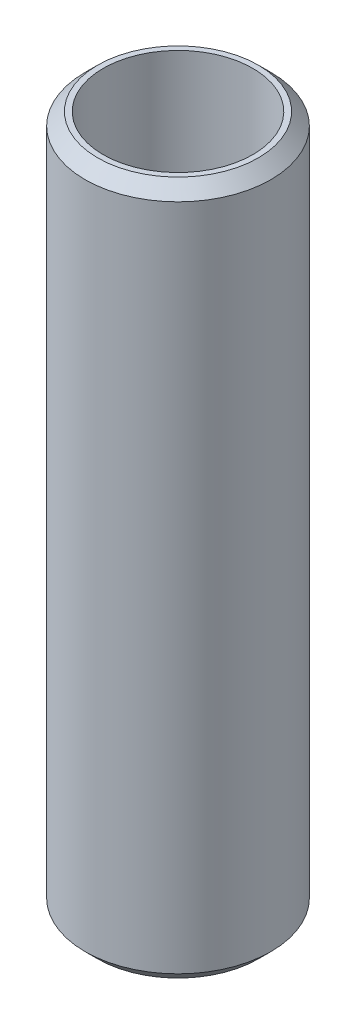
ISO-10303-21;
HEADER;
FILE_DESCRIPTION(('STEP AP214'),'2;1');
FILE_NAME('part.step','',(''),(''),'','','');
FILE_SCHEMA(('AUTOMOTIVE_DESIGN { 1 0 10303 214 1 1 1 1 }'));
ENDSEC;
DATA;
#1=APPLICATION_CONTEXT('core data for automotive mechanical design processes');
#2=APPLICATION_PROTOCOL_DEFINITION('international standard','automotive_design',2000,#1);
#3=PRODUCT_CONTEXT('',#1,'mechanical');
#4=PRODUCT('Part','Part','',(#3));
#5=PRODUCT_RELATED_PRODUCT_CATEGORY('part','',(#4));
#6=PRODUCT_DEFINITION_FORMATION('','',#4);
#7=PRODUCT_DEFINITION_CONTEXT('part definition',#1,'design');
#8=PRODUCT_DEFINITION('design','',#6,#7);
#9=PRODUCT_DEFINITION_SHAPE('','',#8);
#10=(LENGTH_UNIT() NAMED_UNIT(*) SI_UNIT(.MILLI.,.METRE.));
#11=(NAMED_UNIT(*) PLANE_ANGLE_UNIT() SI_UNIT($,.RADIAN.));
#12=(NAMED_UNIT(*) SI_UNIT($,.STERADIAN.) SOLID_ANGLE_UNIT());
#13=UNCERTAINTY_MEASURE_WITH_UNIT(LENGTH_MEASURE(1.E-05),#10,'distance_accuracy_value','');
#14=(GEOMETRIC_REPRESENTATION_CONTEXT(3) GLOBAL_UNCERTAINTY_ASSIGNED_CONTEXT((#13)) GLOBAL_UNIT_ASSIGNED_CONTEXT((#10,
#11,#12)) REPRESENTATION_CONTEXT('',''));
#15=CARTESIAN_POINT('',(0.,0.,0.));
#16=DIRECTION('',(0.,0.,1.));
#17=DIRECTION('',(1.,0.,0.));
#18=AXIS2_PLACEMENT_3D('',#15,#16,#17);
#19=CARTESIAN_POINT('',(0.,205.301103872429,0.));
#20=DIRECTION('',(0.,-1.,0.));
#21=DIRECTION('',(0.,0.,-1.));
#22=AXIS2_PLACEMENT_3D('',#19,#20,#21);
#23=CYLINDRICAL_SURFACE('',#22,27.5);
#24=CARTESIAN_POINT('',(0.,201.583253664459,0.));
#25=DIRECTION('',(0.,1.,0.));
#26=DIRECTION('',(0.,0.,1.));
#27=AXIS2_PLACEMENT_3D('',#24,#25,#26);
#28=CIRCLE('',#27,27.5);
#29=CARTESIAN_POINT('',(0.,201.583253664459,-27.5));
#30=VERTEX_POINT('',#29);
#31=EDGE_CURVE('E50',#30,#30,#28,.F.);
#32=CARTESIAN_POINT('',(0.,3.71785020797022,0.));
#33=DIRECTION('',(0.,1.,0.));
#34=DIRECTION('',(0.,0.,1.));
#35=AXIS2_PLACEMENT_3D('',#32,#33,#34);
#36=CIRCLE('',#35,27.5);
#37=CARTESIAN_POINT('',(0.,3.71785020797022,-27.5));
#38=VERTEX_POINT('',#37);
#39=EDGE_CURVE('E51',#38,#38,#36,.T.);
#40=CARTESIAN_POINT('',(0.,201.583253664459,-27.5));
#41=CARTESIAN_POINT('',(0.,199.522155711787,-27.5));
#42=CARTESIAN_POINT('',(0.,197.461057759116,-27.5));
#43=CARTESIAN_POINT('',(0.,193.338861853772,-27.5));
#44=CARTESIAN_POINT('',(0.,191.2777639011,-27.5));
#45=CARTESIAN_POINT('',(0.,187.155567995757,-27.5));
#46=CARTESIAN_POINT('',(0.,185.094470043085,-27.5));
#47=CARTESIAN_POINT('',(0.,180.972274137741,-27.5));
#48=CARTESIAN_POINT('',(0.,178.91117618507,-27.5));
#49=CARTESIAN_POINT('',(0.,174.788980279726,-27.5));
#50=CARTESIAN_POINT('',(0.,172.727882327054,-27.5));
#51=CARTESIAN_POINT('',(0.,168.605686421711,-27.5));
#52=CARTESIAN_POINT('',(0.,166.544588469039,-27.5));
#53=CARTESIAN_POINT('',(0.,162.422392563696,-27.5));
#54=CARTESIAN_POINT('',(0.,160.361294611024,-27.5));
#55=CARTESIAN_POINT('',(0.,156.23909870568,-27.5));
#56=CARTESIAN_POINT('',(0.,154.178000753009,-27.5));
#57=CARTESIAN_POINT('',(0.,150.055804847665,-27.5));
#58=CARTESIAN_POINT('',(0.,147.994706894993,-27.5));
#59=CARTESIAN_POINT('',(0.,143.87251098965,-27.5));
#60=CARTESIAN_POINT('',(0.,141.811413036978,-27.5));
#61=CARTESIAN_POINT('',(0.,137.689217131635,-27.5));
#62=CARTESIAN_POINT('',(0.,135.628119178963,-27.5));
#63=CARTESIAN_POINT('',(0.,131.505923273619,-27.5));
#64=CARTESIAN_POINT('',(0.,129.444825320948,-27.5));
#65=CARTESIAN_POINT('',(0.,125.322629415604,-27.5));
#66=CARTESIAN_POINT('',(0.,123.261531462932,-27.5));
#67=CARTESIAN_POINT('',(0.,119.139335557589,-27.5));
#68=CARTESIAN_POINT('',(0.,117.078237604917,-27.5));
#69=CARTESIAN_POINT('',(0.,112.956041699573,-27.5));
#70=CARTESIAN_POINT('',(0.,110.894943746902,-27.5));
#71=CARTESIAN_POINT('',(0.,106.772747841558,-27.5));
#72=CARTESIAN_POINT('',(0.,104.711649888886,-27.5));
#73=CARTESIAN_POINT('',(0.,100.589453983543,-27.5));
#74=CARTESIAN_POINT('',(0.,98.5283560308711,-27.5));
#75=CARTESIAN_POINT('',(0.,94.4061601255276,-27.5));
#76=CARTESIAN_POINT('',(0.,92.3450621728559,-27.5));
#77=CARTESIAN_POINT('',(0.,88.2228662675123,-27.5));
#78=CARTESIAN_POINT('',(0.,86.1617683148406,-27.5));
#79=CARTESIAN_POINT('',(0.,82.0395724094971,-27.5));
#80=CARTESIAN_POINT('',(0.,79.9784744568253,-27.5));
#81=CARTESIAN_POINT('',(0.,75.8562785514818,-27.5));
#82=CARTESIAN_POINT('',(0.,73.79518059881,-27.5));
#83=CARTESIAN_POINT('',(0.,69.6729846934665,-27.5));
#84=CARTESIAN_POINT('',(0.,67.6118867407948,-27.5));
#85=CARTESIAN_POINT('',(0.,63.4896908354512,-27.5));
#86=CARTESIAN_POINT('',(0.,61.4285928827795,-27.5));
#87=CARTESIAN_POINT('',(0.,57.306396977436,-27.5));
#88=CARTESIAN_POINT('',(0.,55.2452990247642,-27.5));
#89=CARTESIAN_POINT('',(0.,51.1231031194207,-27.5));
#90=CARTESIAN_POINT('',(0.,49.0620051667489,-27.5));
#91=CARTESIAN_POINT('',(0.,44.9398092614054,-27.5));
#92=CARTESIAN_POINT('',(0.,42.8787113087336,-27.5));
#93=CARTESIAN_POINT('',(0.,38.7565154033901,-27.5));
#94=CARTESIAN_POINT('',(0.,36.6954174507184,-27.5));
#95=CARTESIAN_POINT('',(0.,32.5732215453749,-27.5));
#96=CARTESIAN_POINT('',(0.,30.5121235927031,-27.5));
#97=CARTESIAN_POINT('',(0.,26.3899276873596,-27.5));
#98=CARTESIAN_POINT('',(0.,24.3288297346878,-27.5));
#99=CARTESIAN_POINT('',(0.,20.2066338293443,-27.5));
#100=CARTESIAN_POINT('',(0.,18.1455358766725,-27.5));
#101=CARTESIAN_POINT('',(0.,14.023339971329,-27.5));
#102=CARTESIAN_POINT('',(0.,11.9622420186573,-27.5));
#103=CARTESIAN_POINT('',(0.,7.84004611331376,-27.5));
#104=CARTESIAN_POINT('',(0.,5.77894816064199,-27.5));
#105=CARTESIAN_POINT('',(0.,3.71785020797022,-27.5));
#106=B_SPLINE_CURVE_WITH_KNOTS('',3,(#40,#41,#42,#43,#44,#45,#46,#47,#48,#49,#50,#51,#52,#53,
#54,#55,#56,#57,#58,#59,#60,#61,#62,#63,#64,#65,#66,#67,#68,#69,#70,#71,#72,#73,#74,#75,#76,#77,
#78,#79,#80,#81,#82,#83,#84,#85,#86,#87,#88,#89,#90,#91,#92,#93,#94,#95,#96,#97,#98,#99,#100,
#101,#102,#103,#104,#105),.UNSPECIFIED.,.F.,.F.,(4,2,2,2,2,2,2,2,2,2,2,2,2,2,2,2,2,2,2,2,2,2,2,
2,2,2,2,2,2,2,2,2,4),(0.,6.18329385801525,12.3665877160306,18.5498815740458,24.7331754320611,
30.9164692900764,37.0997631480917,43.2830570061069,49.4663508641222,55.6496447221375,
61.8329385801528,68.016232438168,74.1995262961833,80.3828201541986,86.5661140122139,
92.7494078702291,98.9327017282444,105.11599558626,111.299289444275,117.48258330229,
123.665877160306,129.849171018321,136.032464876336,142.215758734351,148.399052592367,
154.582346450382,160.765640308397,166.948934166412,173.132228024428,179.315521882443,
185.498815740458,191.682109598474,197.865403456489),.UNSPECIFIED.);
#107=EDGE_CURVE('BSEAM39',#30,#38,#106,.T.);
#108=ORIENTED_EDGE('',*,*,#31,.T.);
#109=ORIENTED_EDGE('',*,*,#39,.T.);
#110=ORIENTED_EDGE('',*,*,#107,.T.);
#111=ORIENTED_EDGE('',*,*,#107,.F.);
#112=EDGE_LOOP('',(#108,#110,#109,#111));
#113=FACE_BOUND('',#112,.T.);
#114=ADVANCED_FACE('F39',(#113),#23,.T.);
#115=CARTESIAN_POINT('',(0.,205.301103872429,0.));
#116=DIRECTION('',(0.,1.,0.));
#117=DIRECTION('',(0.,0.,1.));
#118=AXIS2_PLACEMENT_3D('',#115,#116,#117);
#119=PLANE('',#118);
#120=CARTESIAN_POINT('',(0.,205.301103872429,0.));
#121=DIRECTION('',(0.,1.,0.));
#122=DIRECTION('',(0.,0.,1.));
#123=AXIS2_PLACEMENT_3D('',#120,#121,#122);
#124=CIRCLE('',#123,23.7821497920297);
#125=CARTESIAN_POINT('',(0.,205.301103872429,-23.7821497920297));
#126=VERTEX_POINT('',#125);
#127=EDGE_CURVE('E54',#126,#126,#124,.T.);
#128=ORIENTED_EDGE('',*,*,#127,.T.);
#129=EDGE_LOOP('',(#128));
#130=FACE_BOUND('',#129,.T.);
#131=CARTESIAN_POINT('',(0.,205.301103872429,0.));
#132=DIRECTION('',(0.,1.,0.));
#133=DIRECTION('',(0.,0.,1.));
#134=AXIS2_PLACEMENT_3D('',#131,#132,#133);
#135=CIRCLE('',#134,22.1429841899272);
#136=CARTESIAN_POINT('',(0.,205.301103872429,22.1429841899272));
#137=VERTEX_POINT('',#136);
#138=EDGE_CURVE('E58',#137,#137,#135,.T.);
#139=ORIENTED_EDGE('',*,*,#138,.F.);
#140=EDGE_LOOP('',(#139));
#141=FACE_BOUND('',#140,.T.);
#142=ADVANCED_FACE('F69',(#130,#141),#119,.T.);
#143=CARTESIAN_POINT('',(0.,0.,0.));
#144=DIRECTION('',(0.,1.,0.));
#145=DIRECTION('',(0.,0.,1.));
#146=AXIS2_PLACEMENT_3D('',#143,#144,#145);
#147=PLANE('',#146);
#148=CARTESIAN_POINT('',(0.,0.,0.));
#149=DIRECTION('',(0.,1.,0.));
#150=DIRECTION('',(0.,0.,1.));
#151=AXIS2_PLACEMENT_3D('',#148,#149,#150);
#152=CIRCLE('',#151,23.7821497920297);
#153=CARTESIAN_POINT('',(0.,0.,23.7821497920297));
#154=VERTEX_POINT('',#153);
#155=EDGE_CURVE('E10',#154,#154,#152,.F.);
#156=ORIENTED_EDGE('',*,*,#155,.T.);
#157=EDGE_LOOP('',(#156));
#158=FACE_BOUND('',#157,.T.);
#159=CARTESIAN_POINT('',(0.,0.,0.));
#160=DIRECTION('',(0.,1.,0.));
#161=DIRECTION('',(0.,0.,1.));
#162=AXIS2_PLACEMENT_3D('',#159,#160,#161);
#163=CIRCLE('',#162,22.1429841899272);
#164=CARTESIAN_POINT('',(0.,0.,22.1429841899272));
#165=VERTEX_POINT('',#164);
#166=EDGE_CURVE('E63',#165,#165,#163,.T.);
#167=ORIENTED_EDGE('',*,*,#166,.T.);
#168=EDGE_LOOP('',(#167));
#169=FACE_BOUND('',#168,.T.);
#170=ADVANCED_FACE('F75',(#158,#169),#147,.F.);
#171=CARTESIAN_POINT('',(0.,205.301103872429,0.));
#172=DIRECTION('',(0.,-1.,0.));
#173=DIRECTION('',(0.,0.,-1.));
#174=AXIS2_PLACEMENT_3D('',#171,#172,#173);
#175=CYLINDRICAL_SURFACE('',#174,22.1429841899272);
#176=ORIENTED_EDGE('',*,*,#138,.T.);
#177=EDGE_LOOP('',(#176));
#178=FACE_BOUND('',#177,.T.);
#179=ORIENTED_EDGE('',*,*,#166,.F.);
#180=EDGE_LOOP('',(#179));
#181=FACE_BOUND('',#180,.T.);
#182=ADVANCED_FACE('F70',(#178,#181),#175,.F.);
#183=CARTESIAN_POINT('',(0.,205.301103872429,0.));
#184=DIRECTION('',(0.,-1.,0.));
#185=DIRECTION('',(0.,0.,-1.));
#186=AXIS2_PLACEMENT_3D('',#183,#184,#185);
#187=CONICAL_SURFACE('',#186,23.7821497920297,0.785398163397446);
#188=CARTESIAN_POINT('',(0.,201.583253664459,-27.5));
#189=CARTESIAN_POINT('',(0.,201.621981270792,-27.461272393667));
#190=CARTESIAN_POINT('',(0.,201.660708877125,-27.422544787334));
#191=CARTESIAN_POINT('',(0.,201.738164089791,-27.3450895746679));
#192=CARTESIAN_POINT('',(0.,201.776891696124,-27.3063619683349));
#193=CARTESIAN_POINT('',(0.,201.85434690879,-27.2289067556689));
#194=CARTESIAN_POINT('',(0.,201.893074515123,-27.1901791493358));
#195=CARTESIAN_POINT('',(0.,201.970529727789,-27.1127239366698));
#196=CARTESIAN_POINT('',(0.,202.009257334122,-27.0739963303368));
#197=CARTESIAN_POINT('',(0.,202.086712546788,-26.9965411176707));
#198=CARTESIAN_POINT('',(0.,202.125440153121,-26.9578135113377));
#199=CARTESIAN_POINT('',(0.,202.202895365787,-26.8803582986716));
#200=CARTESIAN_POINT('',(0.,202.24162297212,-26.8416306923386));
#201=CARTESIAN_POINT('',(0.,202.319078184787,-26.7641754796726));
#202=CARTESIAN_POINT('',(0.,202.35780579112,-26.7254478733395));
#203=CARTESIAN_POINT('',(0.,202.435261003786,-26.6479926606735));
#204=CARTESIAN_POINT('',(0.,202.473988610119,-26.6092650543405));
#205=CARTESIAN_POINT('',(0.,202.551443822785,-26.5318098416744));
#206=CARTESIAN_POINT('',(0.,202.590171429118,-26.4930822353414));
#207=CARTESIAN_POINT('',(0.,202.667626641784,-26.4156270226754));
#208=CARTESIAN_POINT('',(0.,202.706354248117,-26.3768994163423));
#209=CARTESIAN_POINT('',(0.,202.783809460783,-26.2994442036763));
#210=CARTESIAN_POINT('',(0.,202.822537067116,-26.2607165973433));
#211=CARTESIAN_POINT('',(0.,202.899992279782,-26.1832613846772));
#212=CARTESIAN_POINT('',(0.,202.938719886115,-26.1445337783442));
#213=CARTESIAN_POINT('',(0.,203.016175098781,-26.0670785656781));
#214=CARTESIAN_POINT('',(0.,203.054902705114,-26.0283509593451));
#215=CARTESIAN_POINT('',(0.,203.13235791778,-25.9508957466791));
#216=CARTESIAN_POINT('',(0.,203.171085524113,-25.912168140346));
#217=CARTESIAN_POINT('',(0.,203.248540736779,-25.83471292768));
#218=CARTESIAN_POINT('',(0.,203.287268343112,-25.795985321347));
#219=CARTESIAN_POINT('',(0.,203.364723555778,-25.7185301086809));
#220=CARTESIAN_POINT('',(0.,203.403451162111,-25.6798025023479));
#221=CARTESIAN_POINT('',(0.,203.480906374777,-25.6023472896819));
#222=CARTESIAN_POINT('',(0.,203.51963398111,-25.5636196833488));
#223=CARTESIAN_POINT('',(0.,203.597089193776,-25.4861644706828));
#224=CARTESIAN_POINT('',(0.,203.635816800109,-25.4474368643498));
#225=CARTESIAN_POINT('',(0.,203.713272012775,-25.3699816516837));
#226=CARTESIAN_POINT('',(0.,203.751999619108,-25.3312540453507));
#227=CARTESIAN_POINT('',(0.,203.829454831774,-25.2537988326846));
#228=CARTESIAN_POINT('',(0.,203.868182438107,-25.2150712263516));
#229=CARTESIAN_POINT('',(0.,203.945637650774,-25.1376160136856));
#230=CARTESIAN_POINT('',(0.,203.984365257107,-25.0988884073525));
#231=CARTESIAN_POINT('',(0.,204.061820469773,-25.0214331946865));
#232=CARTESIAN_POINT('',(0.,204.100548076106,-24.9827055883535));
#233=CARTESIAN_POINT('',(0.,204.178003288772,-24.9052503756874));
#234=CARTESIAN_POINT('',(0.,204.216730895105,-24.8665227693544));
#235=CARTESIAN_POINT('',(0.,204.294186107771,-24.7890675566884));
#236=CARTESIAN_POINT('',(0.,204.332913714104,-24.7503399503553));
#237=CARTESIAN_POINT('',(0.,204.41036892677,-24.6728847376893));
#238=CARTESIAN_POINT('',(0.,204.449096533103,-24.6341571313563));
#239=CARTESIAN_POINT('',(0.,204.526551745769,-24.5567019186902));
#240=CARTESIAN_POINT('',(0.,204.565279352102,-24.5179743123572));
#241=CARTESIAN_POINT('',(0.,204.642734564768,-24.4405190996911));
#242=CARTESIAN_POINT('',(0.,204.681462171101,-24.4017914933581));
#243=CARTESIAN_POINT('',(0.,204.758917383767,-24.3243362806921));
#244=CARTESIAN_POINT('',(0.,204.7976449901,-24.285608674359));
#245=CARTESIAN_POINT('',(0.,204.875100202766,-24.208153461693));
#246=CARTESIAN_POINT('',(0.,204.913827809099,-24.16942585536));
#247=CARTESIAN_POINT('',(0.,204.991283021765,-24.0919706426939));
#248=CARTESIAN_POINT('',(0.,205.030010628098,-24.0532430363609));
#249=CARTESIAN_POINT('',(0.,205.107465840764,-23.9757878236949));
#250=CARTESIAN_POINT('',(0.,205.146193447097,-23.9370602173618));
#251=CARTESIAN_POINT('',(0.,205.223648659763,-23.8596050046958));
#252=CARTESIAN_POINT('',(0.,205.262376266096,-23.8208773983628));
#253=CARTESIAN_POINT('',(0.,205.301103872429,-23.7821497920297));
#254=B_SPLINE_CURVE_WITH_KNOTS('',3,(#188,#189,#190,#191,#192,#193,#194,#195,#196,#197,#198,
#199,#200,#201,#202,#203,#204,#205,#206,#207,#208,#209,#210,#211,#212,#213,#214,#215,#216,#217,
#218,#219,#220,#221,#222,#223,#224,#225,#226,#227,#228,#229,#230,#231,#232,#233,#234,#235,#236,
#237,#238,#239,#240,#241,#242,#243,#244,#245,#246,#247,#248,#249,#250,#251,#252,#253),
.UNSPECIFIED.,.F.,.F.,(4,2,2,2,2,2,2,2,2,2,2,2,2,2,2,2,2,2,2,2,2,2,2,2,2,2,2,2,2,2,2,2,4),(0.,
0.164307318343213,0.328614636686447,0.492921955029662,0.657229273372894,0.821536591716109,
0.985843910059342,1.15015122840258,1.31445854674579,1.47876586508902,1.64307318343224,
1.80738050177547,1.97168782011871,2.13599513846192,2.30030245680515,2.46460977514837,
2.6289170934916,2.79322441183484,2.95753173017805,3.12183904852128,3.2861463668645,
3.45045368520773,3.61476100355096,3.77906832189418,3.94337564023741,4.10768295858063,
4.27199027692386,4.43629759526709,4.60060491361031,4.76491223195354,4.92921955029675,
5.09352686863999,5.25783418698322),.UNSPECIFIED.);
#255=EDGE_CURVE('BSEAM81',#30,#126,#254,.T.);
#256=ORIENTED_EDGE('',*,*,#31,.F.);
#257=ORIENTED_EDGE('',*,*,#127,.F.);
#258=ORIENTED_EDGE('',*,*,#255,.T.);
#259=ORIENTED_EDGE('',*,*,#255,.F.);
#260=EDGE_LOOP('',(#256,#258,#257,#259));
#261=FACE_BOUND('',#260,.T.);
#262=ADVANCED_FACE('F81',(#261),#187,.T.);
#263=CARTESIAN_POINT('',(0.,3.71785020797022,0.));
#264=DIRECTION('',(0.,1.,0.));
#265=DIRECTION('',(0.,0.,1.));
#266=AXIS2_PLACEMENT_3D('',#263,#264,#265);
#267=CONICAL_SURFACE('',#266,27.5,0.785398163397453);
#268=ORIENTED_EDGE('',*,*,#155,.F.);
#269=EDGE_LOOP('',(#268));
#270=FACE_BOUND('',#269,.T.);
#271=ORIENTED_EDGE('',*,*,#39,.F.);
#272=EDGE_LOOP('',(#271));
#273=FACE_BOUND('',#272,.T.);
#274=ADVANCED_FACE('F45',(#270,#273),#267,.T.);
#275=CLOSED_SHELL('',(#114,#142,#170,#182,#262,#274));
#276=MANIFOLD_SOLID_BREP('B2',#275);
#277=ADVANCED_BREP_SHAPE_REPRESENTATION('',(#18,#276),#14);
#278=SHAPE_DEFINITION_REPRESENTATION(#9,#277);
ENDSEC;
END-ISO-10303-21;
